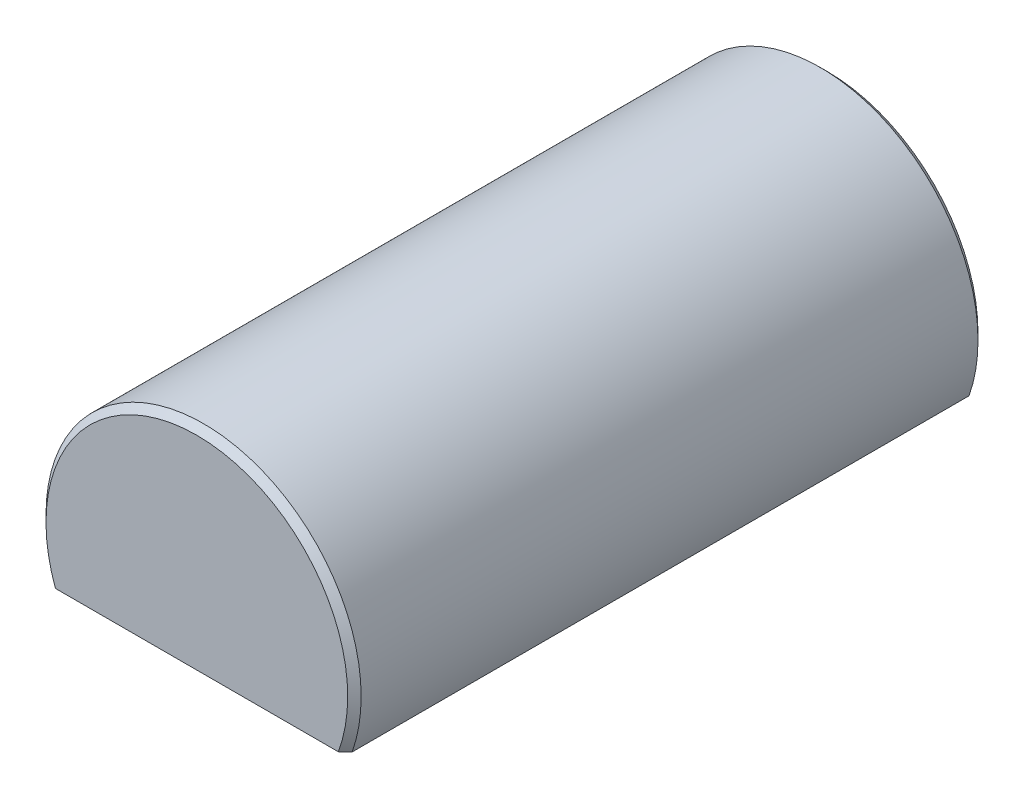
ISO-10303-21;
HEADER;
FILE_DESCRIPTION(('STEP AP214'),'2;1');
FILE_NAME('part.step','',(''),(''),'','','');
FILE_SCHEMA(('AUTOMOTIVE_DESIGN { 1 0 10303 214 1 1 1 1 }'));
ENDSEC;
DATA;
#1=APPLICATION_CONTEXT('core data for automotive mechanical design processes');
#2=APPLICATION_PROTOCOL_DEFINITION('international standard','automotive_design',2000,#1);
#3=PRODUCT_CONTEXT('',#1,'mechanical');
#4=PRODUCT('Part','Part','',(#3));
#5=PRODUCT_RELATED_PRODUCT_CATEGORY('part','',(#4));
#6=PRODUCT_DEFINITION_FORMATION('','',#4);
#7=PRODUCT_DEFINITION_CONTEXT('part definition',#1,'design');
#8=PRODUCT_DEFINITION('design','',#6,#7);
#9=PRODUCT_DEFINITION_SHAPE('','',#8);
#10=(LENGTH_UNIT() NAMED_UNIT(*) SI_UNIT(.MILLI.,.METRE.));
#11=(NAMED_UNIT(*) PLANE_ANGLE_UNIT() SI_UNIT($,.RADIAN.));
#12=(NAMED_UNIT(*) SI_UNIT($,.STERADIAN.) SOLID_ANGLE_UNIT());
#13=UNCERTAINTY_MEASURE_WITH_UNIT(LENGTH_MEASURE(1.E-05),#10,'distance_accuracy_value','');
#14=(GEOMETRIC_REPRESENTATION_CONTEXT(3) GLOBAL_UNCERTAINTY_ASSIGNED_CONTEXT((#13)) GLOBAL_UNIT_ASSIGNED_CONTEXT((#10,
#11,#12)) REPRESENTATION_CONTEXT('',''));
#15=CARTESIAN_POINT('',(0.,0.,0.));
#16=DIRECTION('',(0.,0.,1.));
#17=DIRECTION('',(1.,0.,0.));
#18=AXIS2_PLACEMENT_3D('',#15,#16,#17);
#19=CARTESIAN_POINT('',(-8.98025612106915,-3.175,-19.05));
#20=DIRECTION('',(0.,1.,0.));
#21=DIRECTION('',(0.,0.,1.));
#22=AXIS2_PLACEMENT_3D('',#19,#20,#21);
#23=PLANE('',#22);
#24=CARTESIAN_POINT('',(0.,-3.175,12.7));
#25=DIRECTION('',(0.,1.,0.));
#26=DIRECTION('',(0.,0.,1.));
#27=AXIS2_PLACEMENT_3D('',#24,#25,#26);
#28=CIRCLE('',#27,2.38125);
#29=CARTESIAN_POINT('',(0.,-3.175,15.08125));
#30=VERTEX_POINT('',#29);
#31=EDGE_CURVE('E152',#30,#30,#28,.T.);
#32=ORIENTED_EDGE('',*,*,#31,.T.);
#33=EDGE_LOOP('',(#32));
#34=FACE_BOUND('',#33,.T.);
#35=CARTESIAN_POINT('',(-19.7595218480049,-3.175,-8.15562099481972));
#36=CARTESIAN_POINT('',(-19.1925140216925,-3.175,-8.71541833970159));
#37=CARTESIAN_POINT('',(-18.6252305331766,-3.175,-9.2749372301075));
#38=CARTESIAN_POINT('',(-17.4894657452954,-3.175,-10.3935596725078));
#39=CARTESIAN_POINT('',(-16.9209838832793,-3.175,-10.9526626531449));
#40=CARTESIAN_POINT('',(-15.7755741167121,-3.175,-12.0770696474654));
#41=CARTESIAN_POINT('',(-15.1986325304486,-3.175,-12.6423597290652));
#42=CARTESIAN_POINT('',(-14.0436688072204,-3.175,-13.7710255464828));
#43=CARTESIAN_POINT('',(-13.4656477108255,-3.175,-14.3344023462318));
#44=CARTESIAN_POINT('',(-12.4705159540613,-3.175,-15.3006344002602));
#45=CARTESIAN_POINT('',(-12.053923381691,-3.175,-15.7040230509635));
#46=CARTESIAN_POINT('',(-11.2192222208861,-3.175,-16.5092923897319));
#47=CARTESIAN_POINT('',(-10.801113522204,-3.175,-16.9111729636285));
#48=CARTESIAN_POINT('',(-9.96180438900596,-3.175,-17.7137894720875));
#49=CARTESIAN_POINT('',(-9.54059885127731,-3.175,-18.1145200738019));
#50=CARTESIAN_POINT('',(-8.69536369274989,-3.175,-18.9127645983045));
#51=CARTESIAN_POINT('',(-8.27133489125377,-3.175,-19.3102793859794));
#52=CARTESIAN_POINT('',(-7.63417072982144,-3.175,-19.9008908184188));
#53=CARTESIAN_POINT('',(-7.42271751985768,-3.175,-20.0958012630927));
#54=CARTESIAN_POINT('',(-6.99843064471583,-3.175,-20.484114250534));
#55=CARTESIAN_POINT('',(-6.78559698276185,-3.175,-20.6775167968208));
#56=CARTESIAN_POINT('',(-6.35793966377379,-3.175,-21.0625925503336));
#57=CARTESIAN_POINT('',(-6.1431140635317,-3.175,-21.254263604613));
#58=CARTESIAN_POINT('',(-5.81916935713244,-3.175,-21.5398164840543));
#59=CARTESIAN_POINT('',(-5.71090790489853,-3.175,-21.63467128779));
#60=CARTESIAN_POINT('',(-5.49371873101143,-3.175,-21.8236251078582));
#61=CARTESIAN_POINT('',(-5.38479097918381,-3.175,-21.9177240895089));
#62=CARTESIAN_POINT('',(-5.05787462655518,-3.175,-22.197831488485));
#63=CARTESIAN_POINT('',(-4.83875951405758,-3.175,-22.3825297757046));
#64=CARTESIAN_POINT('',(-4.39646847568306,-3.175,-22.7469971377807));
#65=CARTESIAN_POINT('',(-4.17329291837066,-3.175,-22.9267666563421));
#66=CARTESIAN_POINT('',(-3.834437030073,-3.175,-23.1907907398475));
#67=CARTESIAN_POINT('',(-3.72089777113939,-3.175,-23.2777913468337));
#68=CARTESIAN_POINT('',(-3.49211368943674,-3.175,-23.4495161287082));
#69=CARTESIAN_POINT('',(-3.37686895479634,-3.175,-23.5342404205902));
#70=CARTESIAN_POINT('',(-3.14439364175474,-3.175,-23.7007968775851));
#71=CARTESIAN_POINT('',(-3.02716412294898,-3.175,-23.7826305180934));
#72=CARTESIAN_POINT('',(-2.79025811492876,-3.175,-23.9426648438419));
#73=CARTESIAN_POINT('',(-2.67058203505147,-3.175,-24.0208661297667));
#74=CARTESIAN_POINT('',(-2.52052463750115,-3.175,-24.1148160231544));
#75=CARTESIAN_POINT('',(-2.49152725675283,-3.175,-24.1327846392309));
#76=CARTESIAN_POINT('',(-2.43335482916832,-3.175,-24.1684360452421));
#77=CARTESIAN_POINT('',(-2.40417977182546,-3.175,-24.1861188180433));
#78=CARTESIAN_POINT('',(-2.31637282554542,-3.175,-24.2387132160758));
#79=CARTESIAN_POINT('',(-2.25746552490121,-3.175,-24.2731669271137));
#80=CARTESIAN_POINT('',(-2.1388499163387,-3.175,-24.3406860355773));
#81=CARTESIAN_POINT('',(-2.07914152230359,-3.175,-24.3737512821406));
#82=CARTESIAN_POINT('',(-1.95887197027486,-3.175,-24.4382873931207));
#83=CARTESIAN_POINT('',(-1.89831082667789,-3.175,-24.4697582844134));
#84=CARTESIAN_POINT('',(-1.71626949487598,-3.175,-24.5609395675323));
#85=CARTESIAN_POINT('',(-1.59343488727855,-3.175,-24.6179939551702));
#86=CARTESIAN_POINT('',(-1.34381268045637,-3.175,-24.7227838688996));
#87=CARTESIAN_POINT('',(-1.21702599819507,-3.175,-24.7705215382717));
#88=CARTESIAN_POINT('',(-0.996141655492447,-3.175,-24.8421407238445));
#89=CARTESIAN_POINT('',(-0.902996312538601,-3.175,-24.8689462359184));
#90=CARTESIAN_POINT('',(-0.714930875138811,-3.175,-24.9153774201317));
#91=CARTESIAN_POINT('',(-0.620011232133145,-3.175,-24.9350048931527));
#92=CARTESIAN_POINT('',(-0.429113820304782,-3.175,-24.9661121942424));
#93=CARTESIAN_POINT('',(-0.333139985715256,-3.175,-24.977615821125));
#94=CARTESIAN_POINT('',(-0.140535175388035,-3.175,-24.9919419026325));
#95=CARTESIAN_POINT('',(-0.0439041966456478,-3.175,-24.9947643175371));
#96=CARTESIAN_POINT('',(0.149406571525482,-3.175,-24.9915593092298));
#97=CARTESIAN_POINT('',(0.246086055980357,-3.175,-24.9855137589473));
#98=CARTESIAN_POINT('',(0.438519900949506,-3.175,-24.9648885054497));
#99=CARTESIAN_POINT('',(0.534274210441915,-3.175,-24.9503083342644));
#100=CARTESIAN_POINT('',(0.724543171122349,-3.175,-24.9133206989412));
#101=CARTESIAN_POINT('',(0.819053137345909,-3.175,-24.8908894409841));
#102=CARTESIAN_POINT('',(1.00615993219385,-3.175,-24.8392005441937));
#103=CARTESIAN_POINT('',(1.0987566521195,-3.175,-24.8099425186606));
#104=CARTESIAN_POINT('',(1.39914147587956,-3.175,-24.7045133797523));
#105=CARTESIAN_POINT('',(1.60270242306785,-3.175,-24.6162210584715));
#106=CARTESIAN_POINT('',(1.90064382775073,-3.175,-24.4691905488746));
#107=CARTESIAN_POINT('',(1.99883579493968,-3.175,-24.4176789268811));
#108=CARTESIAN_POINT('',(2.19303970560462,-3.175,-24.310689348493));
#109=CARTESIAN_POINT('',(2.28905201231676,-3.175,-24.2552120594577));
#110=CARTESIAN_POINT('',(2.4798953128031,-3.175,-24.1406178908477));
#111=CARTESIAN_POINT('',(2.57471092780798,-3.175,-24.0814756653363));
#112=CARTESIAN_POINT('',(2.76264452192865,-3.175,-23.9605532577096));
#113=CARTESIAN_POINT('',(2.85576245952455,-3.175,-23.8987730111995));
#114=CARTESIAN_POINT('',(3.04042937935515,-3.175,-23.7731180965308));
#115=CARTESIAN_POINT('',(3.13197987484903,-3.175,-23.7092456447565));
#116=CARTESIAN_POINT('',(3.31380176333075,-3.175,-23.5797169068744));
#117=CARTESIAN_POINT('',(3.40407320172094,-3.175,-23.5140606843272));
#118=CARTESIAN_POINT('',(3.69141418520661,-3.175,-23.3014229643415));
#119=CARTESIAN_POINT('',(3.88637292900485,-3.175,-23.151588840181));
#120=CARTESIAN_POINT('',(4.27238325952007,-3.175,-22.8469554180238));
#121=CARTESIAN_POINT('',(4.46343425596441,-3.175,-22.6921553788549));
#122=CARTESIAN_POINT('',(4.8426569004591,-3.175,-22.3789080776492));
#123=CARTESIAN_POINT('',(5.03082724140774,-3.175,-22.2204592371161));
#124=CARTESIAN_POINT('',(5.40489471047096,-3.175,-21.9008988903215));
#125=CARTESIAN_POINT('',(5.59079177946467,-3.175,-21.7397873150654));
#126=CARTESIAN_POINT('',(5.96110602166873,-3.175,-21.4152716298885));
#127=CARTESIAN_POINT('',(6.14552029598216,-3.175,-21.251864217334));
#128=CARTESIAN_POINT('',(6.51292767139648,-3.175,-20.923457201654));
#129=CARTESIAN_POINT('',(6.69592075452849,-3.175,-20.7584575784562));
#130=CARTESIAN_POINT('',(7.24309250324783,-3.175,-20.261673690703));
#131=CARTESIAN_POINT('',(7.60556693203492,-3.175,-19.9280132070991));
#132=CARTESIAN_POINT('',(8.32608488808928,-3.175,-19.2586757710046));
#133=CARTESIAN_POINT('',(8.68413999682751,-3.175,-18.9230112401011));
#134=CARTESIAN_POINT('',(9.3981109686738,-3.175,-18.2493694292492));
#135=CARTESIAN_POINT('',(9.75402668851613,-3.175,-17.9113919975865));
#136=CARTESIAN_POINT('',(10.4639630698516,-3.175,-17.2340735330514));
#137=CARTESIAN_POINT('',(10.8179851146935,-3.175,-16.8947339485173));
#138=CARTESIAN_POINT('',(11.5248325294695,-3.175,-16.2148101155024));
#139=CARTESIAN_POINT('',(11.877657897126,-3.175,-15.8742258646551));
#140=CARTESIAN_POINT('',(12.8608487771361,-3.175,-14.9225911287922));
#141=CARTESIAN_POINT('',(13.4902037219096,-3.175,-14.3104968974129));
#142=CARTESIAN_POINT('',(14.7471510999705,-3.175,-13.0841616232172));
#143=CARTESIAN_POINT('',(15.3747430059353,-3.175,-12.4699200405842));
#144=CARTESIAN_POINT('',(16.6291765559097,-3.175,-11.2394794340117));
#145=CARTESIAN_POINT('',(17.2560169180586,-3.175,-10.623279103755));
#146=CARTESIAN_POINT('',(18.5085205845556,-3.175,-9.39003560907936));
#147=CARTESIAN_POINT('',(19.1341841706569,-3.175,-8.77299273086808));
#148=CARTESIAN_POINT('',(19.7595218480049,-3.175,-8.15562099481972));
#149=B_SPLINE_CURVE_WITH_KNOTS('',3,(#35,#36,#37,#38,#39,#40,#41,#42,#43,#44,#45,#46,#47,#48,
#49,#50,#51,#52,#53,#54,#55,#56,#57,#58,#59,#60,#61,#62,#63,#64,#65,#66,#67,#68,#69,#70,#71,#72,
#73,#74,#75,#76,#77,#78,#79,#80,#81,#82,#83,#84,#85,#86,#87,#88,#89,#90,#91,#92,#93,#94,#95,#96,
#97,#98,#99,#100,#101,#102,#103,#104,#105,#106,#107,#108,#109,#110,#111,#112,#113,#114,#115,
#116,#117,#118,#119,#120,#121,#122,#123,#124,#125,#126,#127,#128,#129,#130,#131,#132,#133,#134,
#135,#136,#137,#138,#139,#140,#141,#142,#143,#144,#145,#146,#147,#148),.UNSPECIFIED.,.F.,.F.,(4,
2,2,2,2,2,2,2,2,2,2,2,2,2,2,2,2,2,2,2,2,2,2,2,2,2,2,2,2,2,2,2,2,2,2,2,2,2,2,2,2,2,2,2,2,2,2,2,2,
2,2,2,2,2,2,2,4),(0.,2.39036439291235,4.78241488355238,7.20557841157202,9.62704382276182,
11.3667095083409,13.1065043401574,14.8506262801503,16.594262410402,17.4569983331601,
18.3197322416801,19.1834218216942,19.61523098944,20.0470598592951,20.9067378044763,
21.7663381026297,22.1954349501858,22.6245097015056,23.0533621909907,23.48214350654,
23.5844822858614,23.6868271767687,23.8915394907818,24.096273990368,24.3010050376334,
24.7070199187601,25.1129412871096,25.4034789534971,25.6939436774803,25.9835539148037,
26.2731654772176,26.5633698622611,26.8535901612796,27.144697740264,27.4358218129422,
28.0994930845436,28.4321147937085,28.7646806590594,29.0998804786146,29.4350884851404,
29.7699521950312,30.1048039884221,30.8423225325695,31.5799516696314,32.3179061382374,
33.0558797581445,33.7950537117308,34.5342369959246,36.0121902906525,37.4845465530704,
38.9570003383383,40.4281684211872,41.899339302724,44.5330975472243,47.1675738718103,
49.8045566225282,52.4407967951232),.UNSPECIFIED.);
#150=CARTESIAN_POINT('',(-8.98025612106915,-3.175,-18.6436));
#151=VERTEX_POINT('',#150);
#152=CARTESIAN_POINT('',(-8.54799631258691,-3.175,-19.05));
#153=VERTEX_POINT('',#152);
#154=EDGE_CURVE('E71',#151,#153,#149,.T.);
#155=ORIENTED_EDGE('',*,*,#154,.T.);
#156=DIRECTION('',(-1.,0.,0.));
#157=VECTOR('',#156,1.);
#158=CARTESIAN_POINT('',(-8.98025612106915,-3.175,-19.05));
#159=LINE('',#158,#157);
#160=CARTESIAN_POINT('',(8.54799631258691,-3.175,-19.05));
#161=VERTEX_POINT('',#160);
#162=EDGE_CURVE('E98',#161,#153,#159,.T.);
#163=ORIENTED_EDGE('',*,*,#162,.F.);
#164=CARTESIAN_POINT('',(8.98025612106915,-3.175,-18.6436));
#165=VERTEX_POINT('',#164);
#166=EDGE_CURVE('E111',#161,#165,#149,.T.);
#167=ORIENTED_EDGE('',*,*,#166,.T.);
#168=DIRECTION('',(0.,0.,1.));
#169=VECTOR('',#168,1.);
#170=CARTESIAN_POINT('',(8.98025612106915,-3.175,-19.05));
#171=LINE('',#170,#169);
#172=CARTESIAN_POINT('',(8.98025612106915,-3.175,18.6436));
#173=VERTEX_POINT('',#172);
#174=EDGE_CURVE('E89',#165,#173,#171,.T.);
#175=ORIENTED_EDGE('',*,*,#174,.T.);
#176=CARTESIAN_POINT('',(19.7595218480049,-3.175,8.15562099481978));
#177=CARTESIAN_POINT('',(19.1925140216925,-3.175,8.71541833970165));
#178=CARTESIAN_POINT('',(18.6252305331766,-3.175,9.27493723010756));
#179=CARTESIAN_POINT('',(17.4894657452954,-3.175,10.3935596725079));
#180=CARTESIAN_POINT('',(16.9209838832793,-3.175,10.9526626531449));
#181=CARTESIAN_POINT('',(15.7755741167121,-3.175,12.0770696474655));
#182=CARTESIAN_POINT('',(15.1986325304486,-3.175,12.6423597290653));
#183=CARTESIAN_POINT('',(14.0436688072205,-3.175,13.7710255464829));
#184=CARTESIAN_POINT('',(13.4656477108256,-3.175,14.3344023462319));
#185=CARTESIAN_POINT('',(12.4705159540613,-3.175,15.3006344002603));
#186=CARTESIAN_POINT('',(12.053923381691,-3.175,15.7040230509635));
#187=CARTESIAN_POINT('',(11.2192222208861,-3.175,16.5092923897319));
#188=CARTESIAN_POINT('',(10.801113522204,-3.175,16.9111729636285));
#189=CARTESIAN_POINT('',(9.96180438900597,-3.175,17.7137894720876));
#190=CARTESIAN_POINT('',(9.54059885127732,-3.175,18.1145200738019));
#191=CARTESIAN_POINT('',(8.6953636927499,-3.175,18.9127645983045));
#192=CARTESIAN_POINT('',(8.27133489125378,-3.175,19.3102793859794));
#193=CARTESIAN_POINT('',(7.63417072982144,-3.175,19.9008908184189));
#194=CARTESIAN_POINT('',(7.42271751985768,-3.175,20.0958012630927));
#195=CARTESIAN_POINT('',(6.99843064471583,-3.175,20.484114250534));
#196=CARTESIAN_POINT('',(6.78559698276185,-3.175,20.6775167968209));
#197=CARTESIAN_POINT('',(6.3579396637738,-3.175,21.0625925503337));
#198=CARTESIAN_POINT('',(6.1431140635317,-3.175,21.254263604613));
#199=CARTESIAN_POINT('',(5.81916935713244,-3.175,21.5398164840543));
#200=CARTESIAN_POINT('',(5.71090790489854,-3.175,21.6346712877901));
#201=CARTESIAN_POINT('',(5.49371873101143,-3.175,21.8236251078583));
#202=CARTESIAN_POINT('',(5.38479097918381,-3.175,21.917724089509));
#203=CARTESIAN_POINT('',(5.05787462655518,-3.175,22.1978314884851));
#204=CARTESIAN_POINT('',(4.83875951405758,-3.175,22.3825297757047));
#205=CARTESIAN_POINT('',(4.39646847568306,-3.175,22.7469971377808));
#206=CARTESIAN_POINT('',(4.17329291837066,-3.175,22.9267666563422));
#207=CARTESIAN_POINT('',(3.834437030073,-3.175,23.1907907398475));
#208=CARTESIAN_POINT('',(3.7208977711394,-3.175,23.2777913468337));
#209=CARTESIAN_POINT('',(3.49211368943674,-3.175,23.4495161287083));
#210=CARTESIAN_POINT('',(3.37686895479635,-3.175,23.5342404205903));
#211=CARTESIAN_POINT('',(3.14439364175474,-3.175,23.7007968775851));
#212=CARTESIAN_POINT('',(3.02716412294899,-3.175,23.7826305180934));
#213=CARTESIAN_POINT('',(2.79025811492877,-3.175,23.942664843842));
#214=CARTESIAN_POINT('',(2.67058203505148,-3.175,24.0208661297668));
#215=CARTESIAN_POINT('',(2.52052463750116,-3.175,24.1148160231545));
#216=CARTESIAN_POINT('',(2.49152725675284,-3.175,24.132784639231));
#217=CARTESIAN_POINT('',(2.43335482916832,-3.175,24.1684360452421));
#218=CARTESIAN_POINT('',(2.40417977182547,-3.175,24.1861188180434));
#219=CARTESIAN_POINT('',(2.31637282554543,-3.175,24.2387132160758));
#220=CARTESIAN_POINT('',(2.25746552490122,-3.175,24.2731669271138));
#221=CARTESIAN_POINT('',(2.13884991633871,-3.175,24.3406860355774));
#222=CARTESIAN_POINT('',(2.0791415223036,-3.175,24.3737512821406));
#223=CARTESIAN_POINT('',(1.95887197027487,-3.175,24.4382873931208));
#224=CARTESIAN_POINT('',(1.8983108266779,-3.175,24.4697582844135));
#225=CARTESIAN_POINT('',(1.71626949487598,-3.175,24.5609395675323));
#226=CARTESIAN_POINT('',(1.59343488727856,-3.175,24.6179939551702));
#227=CARTESIAN_POINT('',(1.34381268045638,-3.175,24.7227838688997));
#228=CARTESIAN_POINT('',(1.21702599819507,-3.175,24.7705215382718));
#229=CARTESIAN_POINT('',(0.996141655492448,-3.175,24.8421407238446));
#230=CARTESIAN_POINT('',(0.902996312538599,-3.175,24.8689462359184));
#231=CARTESIAN_POINT('',(0.714930875138808,-3.175,24.9153774201318));
#232=CARTESIAN_POINT('',(0.620011232133142,-3.175,24.9350048931528));
#233=CARTESIAN_POINT('',(0.429113820304779,-3.175,24.9661121942425));
#234=CARTESIAN_POINT('',(0.333139985715255,-3.175,24.9776158211251));
#235=CARTESIAN_POINT('',(0.140535175388034,-3.175,24.9919419026326));
#236=CARTESIAN_POINT('',(0.0439041966456463,-3.175,24.9947643175371));
#237=CARTESIAN_POINT('',(-0.149406571525484,-3.175,24.9915593092299));
#238=CARTESIAN_POINT('',(-0.246086055980359,-3.175,24.9855137589474));
#239=CARTESIAN_POINT('',(-0.438519900949507,-3.175,24.9648885054498));
#240=CARTESIAN_POINT('',(-0.534274210441916,-3.175,24.9503083342645));
#241=CARTESIAN_POINT('',(-0.72454317112235,-3.175,24.9133206989413));
#242=CARTESIAN_POINT('',(-0.819053137345911,-3.175,24.8908894409842));
#243=CARTESIAN_POINT('',(-1.00615993219385,-3.175,24.8392005441938));
#244=CARTESIAN_POINT('',(-1.0987566521195,-3.175,24.8099425186606));
#245=CARTESIAN_POINT('',(-1.39914147587956,-3.175,24.7045133797524));
#246=CARTESIAN_POINT('',(-1.60270242306786,-3.175,24.6162210584716));
#247=CARTESIAN_POINT('',(-1.90064382775074,-3.175,24.4691905488746));
#248=CARTESIAN_POINT('',(-1.99883579493969,-3.175,24.4176789268812));
#249=CARTESIAN_POINT('',(-2.19303970560463,-3.175,24.3106893484931));
#250=CARTESIAN_POINT('',(-2.28905201231677,-3.175,24.2552120594577));
#251=CARTESIAN_POINT('',(-2.4798953128031,-3.175,24.1406178908477));
#252=CARTESIAN_POINT('',(-2.57471092780799,-3.175,24.0814756653364));
#253=CARTESIAN_POINT('',(-2.76264452192865,-3.175,23.9605532577096));
#254=CARTESIAN_POINT('',(-2.85576245952456,-3.175,23.8987730111996));
#255=CARTESIAN_POINT('',(-3.04042937935515,-3.175,23.7731180965309));
#256=CARTESIAN_POINT('',(-3.13197987484903,-3.175,23.7092456447566));
#257=CARTESIAN_POINT('',(-3.31380176333075,-3.175,23.5797169068745));
#258=CARTESIAN_POINT('',(-3.40407320172095,-3.175,23.5140606843273));
#259=CARTESIAN_POINT('',(-3.69141418520661,-3.175,23.3014229643416));
#260=CARTESIAN_POINT('',(-3.88637292900485,-3.175,23.1515888401811));
#261=CARTESIAN_POINT('',(-4.27238325952008,-3.175,22.8469554180239));
#262=CARTESIAN_POINT('',(-4.46343425596441,-3.175,22.692155378855));
#263=CARTESIAN_POINT('',(-4.8426569004591,-3.175,22.3789080776492));
#264=CARTESIAN_POINT('',(-5.03082724140775,-3.175,22.2204592371162));
#265=CARTESIAN_POINT('',(-5.40489471047097,-3.175,21.9008988903215));
#266=CARTESIAN_POINT('',(-5.59079177946468,-3.175,21.7397873150655));
#267=CARTESIAN_POINT('',(-5.96110602166874,-3.175,21.4152716298885));
#268=CARTESIAN_POINT('',(-6.14552029598217,-3.175,21.2518642173341));
#269=CARTESIAN_POINT('',(-6.51292767139649,-3.175,20.923457201654));
#270=CARTESIAN_POINT('',(-6.6959207545285,-3.175,20.7584575784563));
#271=CARTESIAN_POINT('',(-7.24309250324785,-3.175,20.2616736907031));
#272=CARTESIAN_POINT('',(-7.60556693203494,-3.175,19.9280132070991));
#273=CARTESIAN_POINT('',(-8.3260848880893,-3.175,19.2586757710046));
#274=CARTESIAN_POINT('',(-8.68413999682752,-3.175,18.9230112401011));
#275=CARTESIAN_POINT('',(-9.39811096867382,-3.175,18.2493694292493));
#276=CARTESIAN_POINT('',(-9.75402668851615,-3.175,17.9113919975865));
#277=CARTESIAN_POINT('',(-10.4639630698516,-3.175,17.2340735330514));
#278=CARTESIAN_POINT('',(-10.8179851146935,-3.175,16.8947339485173));
#279=CARTESIAN_POINT('',(-11.5248325294696,-3.175,16.2148101155025));
#280=CARTESIAN_POINT('',(-11.877657897126,-3.175,15.8742258646551));
#281=CARTESIAN_POINT('',(-12.8608487771361,-3.175,14.9225911287922));
#282=CARTESIAN_POINT('',(-13.4902037219097,-3.175,14.3104968974129));
#283=CARTESIAN_POINT('',(-14.7471510999705,-3.175,13.0841616232173));
#284=CARTESIAN_POINT('',(-15.3747430059353,-3.175,12.4699200405843));
#285=CARTESIAN_POINT('',(-16.6291765559097,-3.175,11.2394794340118));
#286=CARTESIAN_POINT('',(-17.2560169180586,-3.175,10.623279103755));
#287=CARTESIAN_POINT('',(-18.5085205845556,-3.175,9.39003560907942));
#288=CARTESIAN_POINT('',(-19.1341841706569,-3.175,8.77299273086814));
#289=CARTESIAN_POINT('',(-19.7595218480049,-3.175,8.15562099481978));
#290=B_SPLINE_CURVE_WITH_KNOTS('',3,(#176,#177,#178,#179,#180,#181,#182,#183,#184,#185,#186,
#187,#188,#189,#190,#191,#192,#193,#194,#195,#196,#197,#198,#199,#200,#201,#202,#203,#204,#205,
#206,#207,#208,#209,#210,#211,#212,#213,#214,#215,#216,#217,#218,#219,#220,#221,#222,#223,#224,
#225,#226,#227,#228,#229,#230,#231,#232,#233,#234,#235,#236,#237,#238,#239,#240,#241,#242,#243,
#244,#245,#246,#247,#248,#249,#250,#251,#252,#253,#254,#255,#256,#257,#258,#259,#260,#261,#262,
#263,#264,#265,#266,#267,#268,#269,#270,#271,#272,#273,#274,#275,#276,#277,#278,#279,#280,#281,
#282,#283,#284,#285,#286,#287,#288,#289),.UNSPECIFIED.,.F.,.F.,(4,2,2,2,2,2,2,2,2,2,2,2,2,2,2,2,
2,2,2,2,2,2,2,2,2,2,2,2,2,2,2,2,2,2,2,2,2,2,2,2,2,2,2,2,2,2,2,2,2,2,2,2,2,2,2,2,4),(0.,
2.39036439291235,4.78241488355238,7.20557841157201,9.62704382276182,11.3667095083409,
13.1065043401574,14.8506262801503,16.594262410402,17.4569983331601,18.3197322416801,
19.1834218216942,19.61523098944,20.0470598592951,20.9067378044763,21.7663381026297,
22.1954349501858,22.6245097015056,23.0533621909907,23.48214350654,23.5844822858614,
23.6868271767687,23.8915394907818,24.096273990368,24.3010050376334,24.7070199187601,
25.1129412871096,25.4034789534971,25.6939436774803,25.9835539148037,26.2731654772176,
26.5633698622612,26.8535901612796,27.144697740264,27.4358218129422,28.0994930845437,
28.4321147937085,28.7646806590594,29.0998804786146,29.4350884851404,29.7699521950312,
30.1048039884221,30.8423225325695,31.5799516696314,32.3179061382375,33.0558797581445,
33.7950537117308,34.5342369959246,36.0121902906525,37.4845465530705,38.9570003383384,
40.4281684211872,41.8993393027241,44.5330975472244,47.1675738718103,49.8045566225282,
52.4407967951232),.UNSPECIFIED.);
#291=CARTESIAN_POINT('',(8.54799631258697,-3.175,19.05));
#292=VERTEX_POINT('',#291);
#293=EDGE_CURVE('E13',#173,#292,#290,.T.);
#294=ORIENTED_EDGE('',*,*,#293,.T.);
#295=DIRECTION('',(-1.,0.,0.));
#296=VECTOR('',#295,1.);
#297=CARTESIAN_POINT('',(-8.98025612106915,-3.175,19.05));
#298=LINE('',#297,#296);
#299=CARTESIAN_POINT('',(-8.54799631258697,-3.175,19.05));
#300=VERTEX_POINT('',#299);
#301=EDGE_CURVE('E64',#292,#300,#298,.T.);
#302=ORIENTED_EDGE('',*,*,#301,.T.);
#303=CARTESIAN_POINT('',(-8.98025612106915,-3.175,18.6436));
#304=VERTEX_POINT('',#303);
#305=EDGE_CURVE('E49',#300,#304,#290,.T.);
#306=ORIENTED_EDGE('',*,*,#305,.T.);
#307=DIRECTION('',(0.,0.,1.));
#308=VECTOR('',#307,1.);
#309=CARTESIAN_POINT('',(-8.98025612106915,-3.175,-19.05));
#310=LINE('',#309,#308);
#311=EDGE_CURVE('E117',#151,#304,#310,.T.);
#312=ORIENTED_EDGE('',*,*,#311,.F.);
#313=EDGE_LOOP('',(#155,#163,#167,#175,#294,#302,#306,#312));
#314=FACE_BOUND('',#313,.T.);
#315=CARTESIAN_POINT('',(0.,-3.175,-12.7));
#316=DIRECTION('',(0.,1.,0.));
#317=DIRECTION('',(0.,0.,1.));
#318=AXIS2_PLACEMENT_3D('',#315,#316,#317);
#319=CIRCLE('',#318,2.38125);
#320=CARTESIAN_POINT('',(0.,-3.175,-10.31875));
#321=VERTEX_POINT('',#320);
#322=EDGE_CURVE('E158',#321,#321,#319,.T.);
#323=ORIENTED_EDGE('',*,*,#322,.T.);
#324=EDGE_LOOP('',(#323));
#325=FACE_BOUND('',#324,.T.);
#326=ADVANCED_FACE('F45',(#34,#314,#325),#23,.F.);
#327=CARTESIAN_POINT('',(0.,0.,19.05));
#328=DIRECTION('',(0.,0.,-1.));
#329=DIRECTION('',(-1.,0.,0.));
#330=AXIS2_PLACEMENT_3D('',#327,#328,#329);
#331=CYLINDRICAL_SURFACE('',#330,9.525);
#332=CARTESIAN_POINT('',(0.,0.,18.6436));
#333=DIRECTION('',(0.,0.,1.));
#334=DIRECTION('',(1.,0.,0.));
#335=AXIS2_PLACEMENT_3D('',#332,#333,#334);
#336=CIRCLE('',#335,9.525);
#337=EDGE_CURVE('E109',#304,#173,#336,.F.);
#338=ORIENTED_EDGE('',*,*,#337,.T.);
#339=ORIENTED_EDGE('',*,*,#174,.F.);
#340=CARTESIAN_POINT('',(0.,0.,-18.6436));
#341=DIRECTION('',(0.,0.,1.));
#342=DIRECTION('',(1.,0.,0.));
#343=AXIS2_PLACEMENT_3D('',#340,#341,#342);
#344=CIRCLE('',#343,9.525);
#345=EDGE_CURVE('E104',#165,#151,#344,.T.);
#346=ORIENTED_EDGE('',*,*,#345,.T.);
#347=ORIENTED_EDGE('',*,*,#311,.T.);
#348=EDGE_LOOP('',(#338,#339,#346,#347));
#349=FACE_BOUND('',#348,.T.);
#350=ADVANCED_FACE('F47',(#349),#331,.T.);
#351=CARTESIAN_POINT('',(0.,0.,19.05));
#352=DIRECTION('',(0.,0.,1.));
#353=DIRECTION('',(1.,0.,0.));
#354=AXIS2_PLACEMENT_3D('',#351,#352,#353);
#355=PLANE('',#354);
#356=ORIENTED_EDGE('',*,*,#301,.F.);
#357=CARTESIAN_POINT('',(0.,0.,19.05));
#358=DIRECTION('',(0.,0.,1.));
#359=DIRECTION('',(1.,0.,0.));
#360=AXIS2_PLACEMENT_3D('',#357,#358,#359);
#361=CIRCLE('',#360,9.11860000000002);
#362=EDGE_CURVE('E97',#292,#300,#361,.T.);
#363=ORIENTED_EDGE('',*,*,#362,.T.);
#364=EDGE_LOOP('',(#356,#363));
#365=FACE_BOUND('',#364,.T.);
#366=ADVANCED_FACE('F96',(#365),#355,.T.);
#367=CARTESIAN_POINT('',(0.,0.,-19.05));
#368=DIRECTION('',(0.,0.,1.));
#369=DIRECTION('',(1.,0.,0.));
#370=AXIS2_PLACEMENT_3D('',#367,#368,#369);
#371=PLANE('',#370);
#372=CARTESIAN_POINT('',(0.,0.,-19.05));
#373=DIRECTION('',(0.,0.,1.));
#374=DIRECTION('',(1.,0.,0.));
#375=AXIS2_PLACEMENT_3D('',#372,#373,#374);
#376=CIRCLE('',#375,9.11859999999996);
#377=EDGE_CURVE('E102',#153,#161,#376,.F.);
#378=ORIENTED_EDGE('',*,*,#377,.T.);
#379=ORIENTED_EDGE('',*,*,#162,.T.);
#380=EDGE_LOOP('',(#378,#379));
#381=FACE_BOUND('',#380,.T.);
#382=ADVANCED_FACE('F137',(#381),#371,.F.);
#383=CARTESIAN_POINT('',(0.,0.,-18.6436));
#384=DIRECTION('',(0.,0.,1.));
#385=DIRECTION('',(1.,0.,0.));
#386=AXIS2_PLACEMENT_3D('',#383,#384,#385);
#387=CONICAL_SURFACE('',#386,9.525,0.785398163397444);
#388=ORIENTED_EDGE('',*,*,#154,.F.);
#389=ORIENTED_EDGE('',*,*,#345,.F.);
#390=ORIENTED_EDGE('',*,*,#166,.F.);
#391=ORIENTED_EDGE('',*,*,#377,.F.);
#392=EDGE_LOOP('',(#388,#389,#390,#391));
#393=FACE_BOUND('',#392,.T.);
#394=ADVANCED_FACE('F119',(#393),#387,.T.);
#395=CARTESIAN_POINT('',(0.,0.,19.05));
#396=DIRECTION('',(0.,0.,-1.));
#397=DIRECTION('',(-1.,0.,0.));
#398=AXIS2_PLACEMENT_3D('',#395,#396,#397);
#399=CONICAL_SURFACE('',#398,9.11860000000002,0.785398163397444);
#400=ORIENTED_EDGE('',*,*,#293,.F.);
#401=ORIENTED_EDGE('',*,*,#337,.F.);
#402=ORIENTED_EDGE('',*,*,#305,.F.);
#403=ORIENTED_EDGE('',*,*,#362,.F.);
#404=EDGE_LOOP('',(#400,#401,#402,#403));
#405=FACE_BOUND('',#404,.T.);
#406=ADVANCED_FACE('F101',(#405),#399,.T.);
#407=CARTESIAN_POINT('',(0.,1.5875,12.7));
#408=DIRECTION('',(0.,-1.,0.));
#409=DIRECTION('',(0.,0.,-1.));
#410=AXIS2_PLACEMENT_3D('',#407,#408,#409);
#411=CYLINDRICAL_SURFACE('',#410,2.38125);
#412=CARTESIAN_POINT('',(0.,1.5875,12.7));
#413=DIRECTION('',(0.,1.,0.));
#414=DIRECTION('',(0.,0.,1.));
#415=AXIS2_PLACEMENT_3D('',#412,#413,#414);
#416=CIRCLE('',#415,2.38125);
#417=CARTESIAN_POINT('',(0.,1.5875,15.08125));
#418=VERTEX_POINT('',#417);
#419=EDGE_CURVE('E99',#418,#418,#416,.T.);
#420=ORIENTED_EDGE('',*,*,#419,.T.);
#421=EDGE_LOOP('',(#420));
#422=FACE_BOUND('',#421,.T.);
#423=ORIENTED_EDGE('',*,*,#31,.F.);
#424=EDGE_LOOP('',(#423));
#425=FACE_BOUND('',#424,.T.);
#426=ADVANCED_FACE('F126',(#422,#425),#411,.F.);
#427=CARTESIAN_POINT('',(0.,1.5875,12.7));
#428=DIRECTION('',(0.,1.,0.));
#429=DIRECTION('',(0.,0.,1.));
#430=AXIS2_PLACEMENT_3D('',#427,#428,#429);
#431=PLANE('',#430);
#432=ORIENTED_EDGE('',*,*,#419,.F.);
#433=EDGE_LOOP('',(#432));
#434=FACE_BOUND('',#433,.T.);
#435=ADVANCED_FACE('F135',(#434),#431,.F.);
#436=CARTESIAN_POINT('',(0.,1.5875,-12.7));
#437=DIRECTION('',(0.,-1.,0.));
#438=DIRECTION('',(0.,0.,-1.));
#439=AXIS2_PLACEMENT_3D('',#436,#437,#438);
#440=CYLINDRICAL_SURFACE('',#439,2.38125);
#441=CARTESIAN_POINT('',(0.,1.5875,-12.7));
#442=DIRECTION('',(0.,1.,0.));
#443=DIRECTION('',(0.,0.,1.));
#444=AXIS2_PLACEMENT_3D('',#441,#442,#443);
#445=CIRCLE('',#444,2.38125);
#446=CARTESIAN_POINT('',(0.,1.5875,-10.31875));
#447=VERTEX_POINT('',#446);
#448=EDGE_CURVE('E155',#447,#447,#445,.T.);
#449=ORIENTED_EDGE('',*,*,#448,.T.);
#450=EDGE_LOOP('',(#449));
#451=FACE_BOUND('',#450,.T.);
#452=ORIENTED_EDGE('',*,*,#322,.F.);
#453=EDGE_LOOP('',(#452));
#454=FACE_BOUND('',#453,.T.);
#455=ADVANCED_FACE('F162',(#451,#454),#440,.F.);
#456=CARTESIAN_POINT('',(0.,1.5875,-12.7));
#457=DIRECTION('',(0.,1.,0.));
#458=DIRECTION('',(0.,0.,1.));
#459=AXIS2_PLACEMENT_3D('',#456,#457,#458);
#460=PLANE('',#459);
#461=ORIENTED_EDGE('',*,*,#448,.F.);
#462=EDGE_LOOP('',(#461));
#463=FACE_BOUND('',#462,.T.);
#464=ADVANCED_FACE('F164',(#463),#460,.F.);
#465=CLOSED_SHELL('',(#326,#350,#366,#382,#394,#406,#426,#435,#455,#464));
#466=MANIFOLD_SOLID_BREP('B2',#465);
#467=ADVANCED_BREP_SHAPE_REPRESENTATION('',(#18,#466),#14);
#468=SHAPE_DEFINITION_REPRESENTATION(#9,#467);
ENDSEC;
END-ISO-10303-21;
